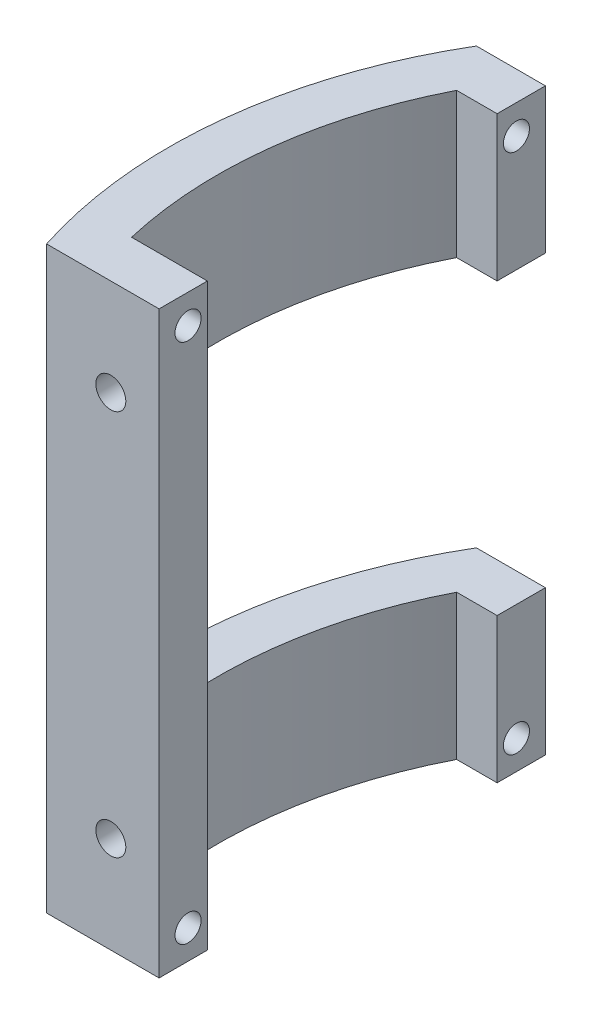
ISO-10303-21;
HEADER;
FILE_DESCRIPTION(('STEP AP214'),'2;1');
FILE_NAME('part.step','',(''),(''),'','','');
FILE_SCHEMA(('AUTOMOTIVE_DESIGN { 1 0 10303 214 1 1 1 1 }'));
ENDSEC;
DATA;
#1=APPLICATION_CONTEXT('core data for automotive mechanical design processes');
#2=APPLICATION_PROTOCOL_DEFINITION('international standard','automotive_design',2000,#1);
#3=PRODUCT_CONTEXT('',#1,'mechanical');
#4=PRODUCT('Part','Part','',(#3));
#5=PRODUCT_RELATED_PRODUCT_CATEGORY('part','',(#4));
#6=PRODUCT_DEFINITION_FORMATION('','',#4);
#7=PRODUCT_DEFINITION_CONTEXT('part definition',#1,'design');
#8=PRODUCT_DEFINITION('design','',#6,#7);
#9=PRODUCT_DEFINITION_SHAPE('','',#8);
#10=(LENGTH_UNIT() NAMED_UNIT(*) SI_UNIT(.MILLI.,.METRE.));
#11=(NAMED_UNIT(*) PLANE_ANGLE_UNIT() SI_UNIT($,.RADIAN.));
#12=(NAMED_UNIT(*) SI_UNIT($,.STERADIAN.) SOLID_ANGLE_UNIT());
#13=UNCERTAINTY_MEASURE_WITH_UNIT(LENGTH_MEASURE(1.E-05),#10,'distance_accuracy_value','');
#14=(GEOMETRIC_REPRESENTATION_CONTEXT(3) GLOBAL_UNCERTAINTY_ASSIGNED_CONTEXT((#13)) GLOBAL_UNIT_ASSIGNED_CONTEXT((#10,
#11,#12)) REPRESENTATION_CONTEXT('',''));
#15=CARTESIAN_POINT('',(0.,0.,0.));
#16=DIRECTION('',(0.,0.,1.));
#17=DIRECTION('',(1.,0.,0.));
#18=AXIS2_PLACEMENT_3D('',#15,#16,#17);
#19=CARTESIAN_POINT('',(0.,60.,0.));
#20=DIRECTION('',(0.,-1.,0.));
#21=DIRECTION('',(0.,0.,-1.));
#22=AXIS2_PLACEMENT_3D('',#19,#20,#21);
#23=CYLINDRICAL_SURFACE('',#22,44.);
#24=CARTESIAN_POINT('',(0.,15.,0.));
#25=DIRECTION('',(0.,-1.,0.));
#26=DIRECTION('',(0.,0.,-1.));
#27=AXIS2_PLACEMENT_3D('',#24,#25,#26);
#28=CIRCLE('',#27,44.);
#29=CARTESIAN_POINT('',(-42.8485705712571,15.,10.));
#30=VERTEX_POINT('',#29);
#31=CARTESIAN_POINT('',(-39.1918358845309,15.,-20.));
#32=VERTEX_POINT('',#31);
#33=EDGE_CURVE('E201',#30,#32,#28,.T.);
#34=ORIENTED_EDGE('',*,*,#33,.F.);
#35=DIRECTION('',(0.,-1.,0.));
#36=VECTOR('',#35,1.);
#37=CARTESIAN_POINT('',(-42.8485705712571,60.,10.));
#38=LINE('',#37,#36);
#39=CARTESIAN_POINT('',(-42.8485705712571,0.,10.));
#40=VERTEX_POINT('',#39);
#41=EDGE_CURVE('E104',#30,#40,#38,.T.);
#42=ORIENTED_EDGE('',*,*,#41,.T.);
#43=CARTESIAN_POINT('',(0.,0.,0.));
#44=DIRECTION('',(0.,1.,0.));
#45=DIRECTION('',(0.,0.,1.));
#46=AXIS2_PLACEMENT_3D('',#43,#44,#45);
#47=CIRCLE('',#46,44.);
#48=CARTESIAN_POINT('',(-39.1918358845309,0.,-20.));
#49=VERTEX_POINT('',#48);
#50=EDGE_CURVE('E198',#49,#40,#47,.T.);
#51=ORIENTED_EDGE('',*,*,#50,.F.);
#52=DIRECTION('',(0.,-1.,0.));
#53=VECTOR('',#52,1.);
#54=CARTESIAN_POINT('',(-39.1918358845309,60.,-20.));
#55=LINE('',#54,#53);
#56=EDGE_CURVE('E53',#32,#49,#55,.T.);
#57=ORIENTED_EDGE('',*,*,#56,.F.);
#58=EDGE_LOOP('',(#34,#42,#51,#57));
#59=FACE_BOUND('',#58,.T.);
#60=ADVANCED_FACE('F44',(#59),#23,.F.);
#61=CARTESIAN_POINT('',(0.,60.,-20.));
#62=DIRECTION('',(0.,0.,-1.));
#63=DIRECTION('',(-1.,0.,0.));
#64=AXIS2_PLACEMENT_3D('',#61,#62,#63);
#65=PLANE('',#64);
#66=DIRECTION('',(0.,-1.,0.));
#67=VECTOR('',#66,1.);
#68=CARTESIAN_POINT('',(-35.,60.,-20.));
#69=LINE('',#68,#67);
#70=CARTESIAN_POINT('',(-35.,15.,-20.));
#71=VERTEX_POINT('',#70);
#72=CARTESIAN_POINT('',(-35.,0.,-20.));
#73=VERTEX_POINT('',#72);
#74=EDGE_CURVE('E293',#71,#73,#69,.T.);
#75=ORIENTED_EDGE('',*,*,#74,.F.);
#76=DIRECTION('',(-1.,0.,0.));
#77=VECTOR('',#76,1.);
#78=CARTESIAN_POINT('',(0.,15.,-20.));
#79=LINE('',#78,#77);
#80=EDGE_CURVE('E205',#71,#32,#79,.T.);
#81=ORIENTED_EDGE('',*,*,#80,.T.);
#82=ORIENTED_EDGE('',*,*,#56,.T.);
#83=DIRECTION('',(1.,0.,0.));
#84=VECTOR('',#83,1.);
#85=CARTESIAN_POINT('',(0.,0.,-20.));
#86=LINE('',#85,#84);
#87=EDGE_CURVE('E306',#49,#73,#86,.T.);
#88=ORIENTED_EDGE('',*,*,#87,.T.);
#89=EDGE_LOOP('',(#75,#81,#82,#88));
#90=FACE_BOUND('',#89,.T.);
#91=ADVANCED_FACE('F285',(#90),#65,.F.);
#92=CARTESIAN_POINT('',(-35.,60.,0.));
#93=DIRECTION('',(1.,0.,0.));
#94=DIRECTION('',(0.,0.,-1.));
#95=AXIS2_PLACEMENT_3D('',#92,#93,#94);
#96=PLANE('',#95);
#97=CARTESIAN_POINT('',(-35.,3.,-22.));
#98=DIRECTION('',(1.,0.,0.));
#99=DIRECTION('',(0.,0.,-1.));
#100=AXIS2_PLACEMENT_3D('',#97,#98,#99);
#101=CIRCLE('',#100,1.35);
#102=CARTESIAN_POINT('',(-35.,3.,-23.35));
#103=VERTEX_POINT('',#102);
#104=EDGE_CURVE('E260',#103,#103,#101,.T.);
#105=ORIENTED_EDGE('',*,*,#104,.F.);
#106=EDGE_LOOP('',(#105));
#107=FACE_BOUND('',#106,.T.);
#108=DIRECTION('',(0.,0.,-1.));
#109=VECTOR('',#108,1.);
#110=CARTESIAN_POINT('',(-35.,15.,10.));
#111=LINE('',#110,#109);
#112=CARTESIAN_POINT('',(-35.,15.,-25.));
#113=VERTEX_POINT('',#112);
#114=EDGE_CURVE('E229',#71,#113,#111,.T.);
#115=ORIENTED_EDGE('',*,*,#114,.F.);
#116=ORIENTED_EDGE('',*,*,#74,.T.);
#117=DIRECTION('',(0.,0.,1.));
#118=VECTOR('',#117,1.);
#119=CARTESIAN_POINT('',(-35.,0.,0.));
#120=LINE('',#119,#118);
#121=CARTESIAN_POINT('',(-35.,0.,-25.));
#122=VERTEX_POINT('',#121);
#123=EDGE_CURVE('E339',#122,#73,#120,.T.);
#124=ORIENTED_EDGE('',*,*,#123,.F.);
#125=DIRECTION('',(0.,-1.,0.));
#126=VECTOR('',#125,1.);
#127=CARTESIAN_POINT('',(-35.,60.,-25.));
#128=LINE('',#127,#126);
#129=EDGE_CURVE('E296',#113,#122,#128,.T.);
#130=ORIENTED_EDGE('',*,*,#129,.F.);
#131=EDGE_LOOP('',(#115,#116,#124,#130));
#132=FACE_BOUND('',#131,.T.);
#133=ADVANCED_FACE('F281',(#107,#132),#96,.T.);
#134=CARTESIAN_POINT('',(0.,60.,-25.));
#135=DIRECTION('',(0.,0.,-1.));
#136=DIRECTION('',(-1.,0.,0.));
#137=AXIS2_PLACEMENT_3D('',#134,#135,#136);
#138=PLANE('',#137);
#139=DIRECTION('',(1.,0.,0.));
#140=VECTOR('',#139,1.);
#141=CARTESIAN_POINT('',(-49.,15.,-25.));
#142=LINE('',#141,#140);
#143=CARTESIAN_POINT('',(-42.142615011411,15.,-25.));
#144=VERTEX_POINT('',#143);
#145=EDGE_CURVE('E223',#144,#113,#142,.T.);
#146=ORIENTED_EDGE('',*,*,#145,.T.);
#147=ORIENTED_EDGE('',*,*,#129,.T.);
#148=DIRECTION('',(1.,0.,0.));
#149=VECTOR('',#148,1.);
#150=CARTESIAN_POINT('',(0.,0.,-25.));
#151=LINE('',#150,#149);
#152=CARTESIAN_POINT('',(-42.142615011411,0.,-25.));
#153=VERTEX_POINT('',#152);
#154=EDGE_CURVE('E335',#153,#122,#151,.T.);
#155=ORIENTED_EDGE('',*,*,#154,.F.);
#156=DIRECTION('',(0.,-1.,0.));
#157=VECTOR('',#156,1.);
#158=CARTESIAN_POINT('',(-42.142615011411,60.,-25.));
#159=LINE('',#158,#157);
#160=EDGE_CURVE('E319',#144,#153,#159,.T.);
#161=ORIENTED_EDGE('',*,*,#160,.F.);
#162=EDGE_LOOP('',(#146,#147,#155,#161));
#163=FACE_BOUND('',#162,.T.);
#164=ADVANCED_FACE('F284',(#163),#138,.T.);
#165=CARTESIAN_POINT('',(0.,45.,0.));
#166=DIRECTION('',(0.,1.,0.));
#167=DIRECTION('',(0.,0.,1.));
#168=AXIS2_PLACEMENT_3D('',#165,#166,#167);
#169=CIRCLE('',#168,44.);
#170=CARTESIAN_POINT('',(-39.1918358845309,45.,-20.));
#171=VERTEX_POINT('',#170);
#172=CARTESIAN_POINT('',(-42.8485705712571,45.,10.));
#173=VERTEX_POINT('',#172);
#174=EDGE_CURVE('E213',#171,#173,#169,.T.);
#175=ORIENTED_EDGE('',*,*,#174,.F.);
#176=CARTESIAN_POINT('',(-39.1918358845309,60.,-20.));
#177=VERTEX_POINT('',#176);
#178=EDGE_CURVE('E11',#177,#171,#55,.T.);
#179=ORIENTED_EDGE('',*,*,#178,.F.);
#180=CARTESIAN_POINT('',(0.,60.,0.));
#181=DIRECTION('',(0.,1.,0.));
#182=DIRECTION('',(0.,0.,1.));
#183=AXIS2_PLACEMENT_3D('',#180,#181,#182);
#184=CIRCLE('',#183,44.);
#185=CARTESIAN_POINT('',(-42.8485705712571,60.,10.));
#186=VERTEX_POINT('',#185);
#187=EDGE_CURVE('E175',#177,#186,#184,.T.);
#188=ORIENTED_EDGE('',*,*,#187,.T.);
#189=EDGE_CURVE('E69',#186,#173,#38,.T.);
#190=ORIENTED_EDGE('',*,*,#189,.T.);
#191=EDGE_LOOP('',(#175,#179,#188,#190));
#192=FACE_BOUND('',#191,.T.);
#193=ADVANCED_FACE('F46',(#192),#23,.F.);
#194=ORIENTED_EDGE('',*,*,#178,.T.);
#195=DIRECTION('',(1.,0.,0.));
#196=VECTOR('',#195,1.);
#197=CARTESIAN_POINT('',(0.,45.,-20.));
#198=LINE('',#197,#196);
#199=CARTESIAN_POINT('',(-35.,45.,-20.));
#200=VERTEX_POINT('',#199);
#201=EDGE_CURVE('E217',#171,#200,#198,.T.);
#202=ORIENTED_EDGE('',*,*,#201,.T.);
#203=CARTESIAN_POINT('',(-35.,60.,-20.));
#204=VERTEX_POINT('',#203);
#205=EDGE_CURVE('E309',#204,#200,#69,.T.);
#206=ORIENTED_EDGE('',*,*,#205,.F.);
#207=DIRECTION('',(1.,0.,0.));
#208=VECTOR('',#207,1.);
#209=CARTESIAN_POINT('',(0.,60.,-20.));
#210=LINE('',#209,#208);
#211=EDGE_CURVE('E168',#177,#204,#210,.T.);
#212=ORIENTED_EDGE('',*,*,#211,.F.);
#213=EDGE_LOOP('',(#194,#202,#206,#212));
#214=FACE_BOUND('',#213,.T.);
#215=ADVANCED_FACE('F387',(#214),#65,.F.);
#216=CARTESIAN_POINT('',(-35.,57.,-22.));
#217=DIRECTION('',(1.,0.,0.));
#218=DIRECTION('',(0.,0.,-1.));
#219=AXIS2_PLACEMENT_3D('',#216,#217,#218);
#220=CIRCLE('',#219,1.35);
#221=CARTESIAN_POINT('',(-35.,57.,-23.35));
#222=VERTEX_POINT('',#221);
#223=EDGE_CURVE('E251',#222,#222,#220,.T.);
#224=ORIENTED_EDGE('',*,*,#223,.F.);
#225=EDGE_LOOP('',(#224));
#226=FACE_BOUND('',#225,.T.);
#227=DIRECTION('',(0.,0.,1.));
#228=VECTOR('',#227,1.);
#229=CARTESIAN_POINT('',(-35.,45.,-25.));
#230=LINE('',#229,#228);
#231=CARTESIAN_POINT('',(-35.,45.,-25.));
#232=VERTEX_POINT('',#231);
#233=EDGE_CURVE('E242',#232,#200,#230,.T.);
#234=ORIENTED_EDGE('',*,*,#233,.F.);
#235=CARTESIAN_POINT('',(-35.,60.,-25.));
#236=VERTEX_POINT('',#235);
#237=EDGE_CURVE('E310',#236,#232,#128,.T.);
#238=ORIENTED_EDGE('',*,*,#237,.F.);
#239=DIRECTION('',(0.,0.,1.));
#240=VECTOR('',#239,1.);
#241=CARTESIAN_POINT('',(-35.,60.,0.));
#242=LINE('',#241,#240);
#243=EDGE_CURVE('E160',#236,#204,#242,.T.);
#244=ORIENTED_EDGE('',*,*,#243,.T.);
#245=ORIENTED_EDGE('',*,*,#205,.T.);
#246=EDGE_LOOP('',(#234,#238,#244,#245));
#247=FACE_BOUND('',#246,.T.);
#248=ADVANCED_FACE('F287',(#226,#247),#96,.T.);
#249=DIRECTION('',(1.,0.,0.));
#250=VECTOR('',#249,1.);
#251=CARTESIAN_POINT('',(-49.,45.,-25.));
#252=LINE('',#251,#250);
#253=CARTESIAN_POINT('',(-42.142615011411,45.,-25.));
#254=VERTEX_POINT('',#253);
#255=EDGE_CURVE('E224',#254,#232,#252,.T.);
#256=ORIENTED_EDGE('',*,*,#255,.F.);
#257=CARTESIAN_POINT('',(-42.142615011411,60.,-25.));
#258=VERTEX_POINT('',#257);
#259=EDGE_CURVE('E316',#258,#254,#159,.T.);
#260=ORIENTED_EDGE('',*,*,#259,.F.);
#261=DIRECTION('',(1.,0.,0.));
#262=VECTOR('',#261,1.);
#263=CARTESIAN_POINT('',(0.,60.,-25.));
#264=LINE('',#263,#262);
#265=EDGE_CURVE('E167',#258,#236,#264,.T.);
#266=ORIENTED_EDGE('',*,*,#265,.T.);
#267=ORIENTED_EDGE('',*,*,#237,.T.);
#268=EDGE_LOOP('',(#256,#260,#266,#267));
#269=FACE_BOUND('',#268,.T.);
#270=ADVANCED_FACE('F395',(#269),#138,.T.);
#271=CARTESIAN_POINT('',(0.,60.,0.));
#272=DIRECTION('',(0.,-1.,0.));
#273=DIRECTION('',(0.,0.,-1.));
#274=AXIS2_PLACEMENT_3D('',#271,#272,#273);
#275=CYLINDRICAL_SURFACE('',#274,49.);
#276=ORIENTED_EDGE('',*,*,#259,.T.);
#277=CARTESIAN_POINT('',(0.,45.,0.));
#278=DIRECTION('',(0.,1.,0.));
#279=DIRECTION('',(0.,0.,1.));
#280=AXIS2_PLACEMENT_3D('',#277,#278,#279);
#281=CIRCLE('',#280,49.);
#282=CARTESIAN_POINT('',(-47.9687398208458,45.,10.));
#283=VERTEX_POINT('',#282);
#284=EDGE_CURVE('E60',#254,#283,#281,.T.);
#285=ORIENTED_EDGE('',*,*,#284,.T.);
#286=DIRECTION('',(0.,-1.,0.));
#287=VECTOR('',#286,1.);
#288=CARTESIAN_POINT('',(-47.9687398208458,60.,10.));
#289=LINE('',#288,#287);
#290=CARTESIAN_POINT('',(-47.9687398208458,15.,10.));
#291=VERTEX_POINT('',#290);
#292=EDGE_CURVE('E186',#283,#291,#289,.T.);
#293=ORIENTED_EDGE('',*,*,#292,.T.);
#294=CARTESIAN_POINT('',(0.,15.,0.));
#295=DIRECTION('',(0.,-1.,0.));
#296=DIRECTION('',(0.,0.,-1.));
#297=AXIS2_PLACEMENT_3D('',#294,#295,#296);
#298=CIRCLE('',#297,49.);
#299=EDGE_CURVE('E209',#291,#144,#298,.T.);
#300=ORIENTED_EDGE('',*,*,#299,.T.);
#301=ORIENTED_EDGE('',*,*,#160,.T.);
#302=CARTESIAN_POINT('',(0.,0.,0.));
#303=DIRECTION('',(0.,1.,0.));
#304=DIRECTION('',(0.,0.,1.));
#305=AXIS2_PLACEMENT_3D('',#302,#303,#304);
#306=CIRCLE('',#305,49.);
#307=CARTESIAN_POINT('',(-46.6476151587624,0.,15.));
#308=VERTEX_POINT('',#307);
#309=EDGE_CURVE('E332',#153,#308,#306,.T.);
#310=ORIENTED_EDGE('',*,*,#309,.T.);
#311=DIRECTION('',(0.,-1.,0.));
#312=VECTOR('',#311,1.);
#313=CARTESIAN_POINT('',(-46.6476151587624,60.,15.));
#314=LINE('',#313,#312);
#315=CARTESIAN_POINT('',(-46.6476151587624,60.,15.));
#316=VERTEX_POINT('',#315);
#317=EDGE_CURVE('E153',#316,#308,#314,.T.);
#318=ORIENTED_EDGE('',*,*,#317,.F.);
#319=CARTESIAN_POINT('',(0.,60.,0.));
#320=DIRECTION('',(0.,1.,0.));
#321=DIRECTION('',(0.,0.,1.));
#322=AXIS2_PLACEMENT_3D('',#319,#320,#321);
#323=CIRCLE('',#322,49.);
#324=EDGE_CURVE('E138',#258,#316,#323,.T.);
#325=ORIENTED_EDGE('',*,*,#324,.F.);
#326=EDGE_LOOP('',(#276,#285,#293,#300,#301,#310,#318,#325));
#327=FACE_BOUND('',#326,.T.);
#328=ADVANCED_FACE('F363',(#327),#275,.T.);
#329=CARTESIAN_POINT('',(0.,60.,15.));
#330=DIRECTION('',(0.,0.,-1.));
#331=DIRECTION('',(-1.,0.,0.));
#332=AXIS2_PLACEMENT_3D('',#329,#330,#331);
#333=PLANE('',#332);
#334=CARTESIAN_POINT('',(-39.9976151587624,50.,15.));
#335=DIRECTION('',(0.,0.,-1.));
#336=DIRECTION('',(-1.,0.,0.));
#337=AXIS2_PLACEMENT_3D('',#334,#335,#336);
#338=CIRCLE('',#337,1.55);
#339=CARTESIAN_POINT('',(-41.5476151587624,50.,15.));
#340=VERTEX_POINT('',#339);
#341=EDGE_CURVE('E194',#340,#340,#338,.T.);
#342=ORIENTED_EDGE('',*,*,#341,.T.);
#343=EDGE_LOOP('',(#342));
#344=FACE_BOUND('',#343,.T.);
#345=CARTESIAN_POINT('',(-39.9976151587624,9.99999999999999,15.));
#346=DIRECTION('',(0.,0.,-1.));
#347=DIRECTION('',(-1.,0.,0.));
#348=AXIS2_PLACEMENT_3D('',#345,#346,#347);
#349=CIRCLE('',#348,1.55);
#350=CARTESIAN_POINT('',(-41.5476151587624,9.99999999999999,15.));
#351=VERTEX_POINT('',#350);
#352=EDGE_CURVE('E181',#351,#351,#349,.T.);
#353=ORIENTED_EDGE('',*,*,#352,.T.);
#354=EDGE_LOOP('',(#353));
#355=FACE_BOUND('',#354,.T.);
#356=DIRECTION('',(1.,0.,0.));
#357=VECTOR('',#356,1.);
#358=CARTESIAN_POINT('',(0.,0.,15.));
#359=LINE('',#358,#357);
#360=CARTESIAN_POINT('',(-35.,0.,15.));
#361=VERTEX_POINT('',#360);
#362=EDGE_CURVE('E148',#308,#361,#359,.T.);
#363=ORIENTED_EDGE('',*,*,#362,.T.);
#364=DIRECTION('',(0.,-1.,0.));
#365=VECTOR('',#364,1.);
#366=CARTESIAN_POINT('',(-35.,60.,15.));
#367=LINE('',#366,#365);
#368=CARTESIAN_POINT('',(-35.,60.,15.));
#369=VERTEX_POINT('',#368);
#370=EDGE_CURVE('E145',#369,#361,#367,.T.);
#371=ORIENTED_EDGE('',*,*,#370,.F.);
#372=DIRECTION('',(1.,0.,0.));
#373=VECTOR('',#372,1.);
#374=CARTESIAN_POINT('',(0.,60.,15.));
#375=LINE('',#374,#373);
#376=EDGE_CURVE('E129',#316,#369,#375,.T.);
#377=ORIENTED_EDGE('',*,*,#376,.F.);
#378=ORIENTED_EDGE('',*,*,#317,.T.);
#379=EDGE_LOOP('',(#363,#371,#377,#378));
#380=FACE_BOUND('',#379,.T.);
#381=ADVANCED_FACE('F146',(#344,#355,#380),#333,.F.);
#382=CARTESIAN_POINT('',(-35.,3.,12.));
#383=DIRECTION('',(1.,0.,0.));
#384=DIRECTION('',(0.,0.,-1.));
#385=AXIS2_PLACEMENT_3D('',#382,#383,#384);
#386=CIRCLE('',#385,1.35);
#387=CARTESIAN_POINT('',(-35.,3.,10.65));
#388=VERTEX_POINT('',#387);
#389=EDGE_CURVE('E259',#388,#388,#386,.T.);
#390=ORIENTED_EDGE('',*,*,#389,.F.);
#391=EDGE_LOOP('',(#390));
#392=FACE_BOUND('',#391,.T.);
#393=CARTESIAN_POINT('',(-35.,57.,12.));
#394=DIRECTION('',(1.,0.,0.));
#395=DIRECTION('',(0.,0.,-1.));
#396=AXIS2_PLACEMENT_3D('',#393,#394,#395);
#397=CIRCLE('',#396,1.35);
#398=CARTESIAN_POINT('',(-35.,57.,10.65));
#399=VERTEX_POINT('',#398);
#400=EDGE_CURVE('E247',#399,#399,#397,.T.);
#401=ORIENTED_EDGE('',*,*,#400,.F.);
#402=EDGE_LOOP('',(#401));
#403=FACE_BOUND('',#402,.T.);
#404=CARTESIAN_POINT('',(-35.,0.,10.));
#405=VERTEX_POINT('',#404);
#406=EDGE_CURVE('E329',#405,#361,#120,.T.);
#407=ORIENTED_EDGE('',*,*,#406,.F.);
#408=DIRECTION('',(0.,-1.,0.));
#409=VECTOR('',#408,1.);
#410=CARTESIAN_POINT('',(-35.,60.,10.));
#411=LINE('',#410,#409);
#412=CARTESIAN_POINT('',(-35.,60.,10.));
#413=VERTEX_POINT('',#412);
#414=EDGE_CURVE('E154',#413,#405,#411,.T.);
#415=ORIENTED_EDGE('',*,*,#414,.F.);
#416=EDGE_CURVE('E135',#413,#369,#242,.T.);
#417=ORIENTED_EDGE('',*,*,#416,.T.);
#418=ORIENTED_EDGE('',*,*,#370,.T.);
#419=EDGE_LOOP('',(#407,#415,#417,#418));
#420=FACE_BOUND('',#419,.T.);
#421=ADVANCED_FACE('F156',(#392,#403,#420),#96,.T.);
#422=CARTESIAN_POINT('',(0.,60.,10.));
#423=DIRECTION('',(0.,0.,-1.));
#424=DIRECTION('',(-1.,0.,0.));
#425=AXIS2_PLACEMENT_3D('',#422,#423,#424);
#426=PLANE('',#425);
#427=ORIENTED_EDGE('',*,*,#414,.T.);
#428=DIRECTION('',(1.,0.,0.));
#429=VECTOR('',#428,1.);
#430=CARTESIAN_POINT('',(0.,0.,10.));
#431=LINE('',#430,#429);
#432=EDGE_CURVE('E178',#40,#405,#431,.T.);
#433=ORIENTED_EDGE('',*,*,#432,.F.);
#434=ORIENTED_EDGE('',*,*,#41,.F.);
#435=DIRECTION('',(1.,0.,0.));
#436=VECTOR('',#435,1.);
#437=CARTESIAN_POINT('',(-49.,15.,10.));
#438=LINE('',#437,#436);
#439=EDGE_CURVE('E232',#291,#30,#438,.T.);
#440=ORIENTED_EDGE('',*,*,#439,.F.);
#441=ORIENTED_EDGE('',*,*,#292,.F.);
#442=DIRECTION('',(1.,0.,0.));
#443=VECTOR('',#442,1.);
#444=CARTESIAN_POINT('',(-49.,45.,10.));
#445=LINE('',#444,#443);
#446=EDGE_CURVE('E228',#283,#173,#445,.T.);
#447=ORIENTED_EDGE('',*,*,#446,.T.);
#448=ORIENTED_EDGE('',*,*,#189,.F.);
#449=DIRECTION('',(1.,0.,0.));
#450=VECTOR('',#449,1.);
#451=CARTESIAN_POINT('',(0.,60.,10.));
#452=LINE('',#451,#450);
#453=EDGE_CURVE('E158',#186,#413,#452,.T.);
#454=ORIENTED_EDGE('',*,*,#453,.T.);
#455=EDGE_LOOP('',(#427,#433,#434,#440,#441,#447,#448,#454));
#456=FACE_BOUND('',#455,.T.);
#457=CARTESIAN_POINT('',(-39.9976151587624,50.,10.));
#458=DIRECTION('',(0.,0.,-1.));
#459=DIRECTION('',(-1.,0.,0.));
#460=AXIS2_PLACEMENT_3D('',#457,#458,#459);
#461=CIRCLE('',#460,1.55);
#462=CARTESIAN_POINT('',(-41.5476151587624,50.,10.));
#463=VERTEX_POINT('',#462);
#464=EDGE_CURVE('E190',#463,#463,#461,.T.);
#465=ORIENTED_EDGE('',*,*,#464,.F.);
#466=EDGE_LOOP('',(#465));
#467=FACE_BOUND('',#466,.T.);
#468=CARTESIAN_POINT('',(-39.9976151587624,9.99999999999999,10.));
#469=DIRECTION('',(0.,0.,-1.));
#470=DIRECTION('',(-1.,0.,0.));
#471=AXIS2_PLACEMENT_3D('',#468,#469,#470);
#472=CIRCLE('',#471,1.55);
#473=CARTESIAN_POINT('',(-41.5476151587624,9.99999999999999,10.));
#474=VERTEX_POINT('',#473);
#475=EDGE_CURVE('E185',#474,#474,#472,.T.);
#476=ORIENTED_EDGE('',*,*,#475,.F.);
#477=EDGE_LOOP('',(#476));
#478=FACE_BOUND('',#477,.T.);
#479=ADVANCED_FACE('F350',(#456,#467,#478),#426,.T.);
#480=CARTESIAN_POINT('',(0.,60.,0.));
#481=DIRECTION('',(0.,1.,0.));
#482=DIRECTION('',(0.,0.,1.));
#483=AXIS2_PLACEMENT_3D('',#480,#481,#482);
#484=PLANE('',#483);
#485=ORIENTED_EDGE('',*,*,#187,.F.);
#486=ORIENTED_EDGE('',*,*,#211,.T.);
#487=ORIENTED_EDGE('',*,*,#243,.F.);
#488=ORIENTED_EDGE('',*,*,#265,.F.);
#489=ORIENTED_EDGE('',*,*,#324,.T.);
#490=ORIENTED_EDGE('',*,*,#376,.T.);
#491=ORIENTED_EDGE('',*,*,#416,.F.);
#492=ORIENTED_EDGE('',*,*,#453,.F.);
#493=EDGE_LOOP('',(#485,#486,#487,#488,#489,#490,#491,#492));
#494=FACE_BOUND('',#493,.T.);
#495=ADVANCED_FACE('F132',(#494),#484,.T.);
#496=CARTESIAN_POINT('',(0.,0.,0.));
#497=DIRECTION('',(0.,1.,0.));
#498=DIRECTION('',(0.,0.,1.));
#499=AXIS2_PLACEMENT_3D('',#496,#497,#498);
#500=PLANE('',#499);
#501=ORIENTED_EDGE('',*,*,#50,.T.);
#502=ORIENTED_EDGE('',*,*,#432,.T.);
#503=ORIENTED_EDGE('',*,*,#406,.T.);
#504=ORIENTED_EDGE('',*,*,#362,.F.);
#505=ORIENTED_EDGE('',*,*,#309,.F.);
#506=ORIENTED_EDGE('',*,*,#154,.T.);
#507=ORIENTED_EDGE('',*,*,#123,.T.);
#508=ORIENTED_EDGE('',*,*,#87,.F.);
#509=EDGE_LOOP('',(#501,#502,#503,#504,#505,#506,#507,#508));
#510=FACE_BOUND('',#509,.T.);
#511=ADVANCED_FACE('F349',(#510),#500,.F.);
#512=CARTESIAN_POINT('',(-39.9976151587624,9.99999999999999,15.));
#513=DIRECTION('',(0.,0.,-1.));
#514=DIRECTION('',(-1.,0.,0.));
#515=AXIS2_PLACEMENT_3D('',#512,#513,#514);
#516=CYLINDRICAL_SURFACE('',#515,1.55);
#517=ORIENTED_EDGE('',*,*,#352,.F.);
#518=EDGE_LOOP('',(#517));
#519=FACE_BOUND('',#518,.T.);
#520=ORIENTED_EDGE('',*,*,#475,.T.);
#521=EDGE_LOOP('',(#520));
#522=FACE_BOUND('',#521,.T.);
#523=ADVANCED_FACE('F379',(#519,#522),#516,.F.);
#524=CARTESIAN_POINT('',(-39.9976151587624,50.,15.));
#525=DIRECTION('',(0.,0.,-1.));
#526=DIRECTION('',(-1.,0.,0.));
#527=AXIS2_PLACEMENT_3D('',#524,#525,#526);
#528=CYLINDRICAL_SURFACE('',#527,1.55);
#529=ORIENTED_EDGE('',*,*,#341,.F.);
#530=EDGE_LOOP('',(#529));
#531=FACE_BOUND('',#530,.T.);
#532=ORIENTED_EDGE('',*,*,#464,.T.);
#533=EDGE_LOOP('',(#532));
#534=FACE_BOUND('',#533,.T.);
#535=ADVANCED_FACE('F370',(#531,#534),#528,.F.);
#536=CARTESIAN_POINT('',(-49.,15.,10.));
#537=DIRECTION('',(0.,-1.,0.));
#538=DIRECTION('',(0.,0.,-1.));
#539=AXIS2_PLACEMENT_3D('',#536,#537,#538);
#540=PLANE('',#539);
#541=ORIENTED_EDGE('',*,*,#33,.T.);
#542=ORIENTED_EDGE('',*,*,#80,.F.);
#543=ORIENTED_EDGE('',*,*,#114,.T.);
#544=ORIENTED_EDGE('',*,*,#145,.F.);
#545=ORIENTED_EDGE('',*,*,#299,.F.);
#546=ORIENTED_EDGE('',*,*,#439,.T.);
#547=EDGE_LOOP('',(#541,#542,#543,#544,#545,#546));
#548=FACE_BOUND('',#547,.T.);
#549=ADVANCED_FACE('F367',(#548),#540,.F.);
#550=CARTESIAN_POINT('',(-49.,45.,-25.));
#551=DIRECTION('',(0.,1.,0.));
#552=DIRECTION('',(0.,0.,1.));
#553=AXIS2_PLACEMENT_3D('',#550,#551,#552);
#554=PLANE('',#553);
#555=ORIENTED_EDGE('',*,*,#174,.T.);
#556=ORIENTED_EDGE('',*,*,#446,.F.);
#557=ORIENTED_EDGE('',*,*,#284,.F.);
#558=ORIENTED_EDGE('',*,*,#255,.T.);
#559=ORIENTED_EDGE('',*,*,#233,.T.);
#560=ORIENTED_EDGE('',*,*,#201,.F.);
#561=EDGE_LOOP('',(#555,#556,#557,#558,#559,#560));
#562=FACE_BOUND('',#561,.T.);
#563=ADVANCED_FACE('F369',(#562),#554,.F.);
#564=CARTESIAN_POINT('',(-40.,57.,12.));
#565=DIRECTION('',(1.,0.,0.));
#566=DIRECTION('',(0.,0.,-1.));
#567=AXIS2_PLACEMENT_3D('',#564,#565,#566);
#568=CYLINDRICAL_SURFACE('',#567,1.35);
#569=CARTESIAN_POINT('',(-40.,57.,12.));
#570=DIRECTION('',(1.,0.,0.));
#571=DIRECTION('',(0.,0.,-1.));
#572=AXIS2_PLACEMENT_3D('',#569,#570,#571);
#573=CIRCLE('',#572,1.35);
#574=CARTESIAN_POINT('',(-40.,57.,10.65));
#575=VERTEX_POINT('',#574);
#576=EDGE_CURVE('E246',#575,#575,#573,.T.);
#577=ORIENTED_EDGE('',*,*,#576,.F.);
#578=EDGE_LOOP('',(#577));
#579=FACE_BOUND('',#578,.T.);
#580=ORIENTED_EDGE('',*,*,#400,.T.);
#581=EDGE_LOOP('',(#580));
#582=FACE_BOUND('',#581,.T.);
#583=ADVANCED_FACE('F376',(#579,#582),#568,.F.);
#584=CARTESIAN_POINT('',(-40.,57.,12.));
#585=DIRECTION('',(1.,0.,0.));
#586=DIRECTION('',(0.,0.,-1.));
#587=AXIS2_PLACEMENT_3D('',#584,#585,#586);
#588=PLANE('',#587);
#589=ORIENTED_EDGE('',*,*,#576,.T.);
#590=EDGE_LOOP('',(#589));
#591=FACE_BOUND('',#590,.T.);
#592=ADVANCED_FACE('F537',(#591),#588,.T.);
#593=CARTESIAN_POINT('',(-40.,3.,12.));
#594=DIRECTION('',(1.,0.,0.));
#595=DIRECTION('',(0.,0.,-1.));
#596=AXIS2_PLACEMENT_3D('',#593,#594,#595);
#597=CYLINDRICAL_SURFACE('',#596,1.35);
#598=CARTESIAN_POINT('',(-40.,3.,12.));
#599=DIRECTION('',(1.,0.,0.));
#600=DIRECTION('',(0.,0.,-1.));
#601=AXIS2_PLACEMENT_3D('',#598,#599,#600);
#602=CIRCLE('',#601,1.35);
#603=CARTESIAN_POINT('',(-40.,3.,10.65));
#604=VERTEX_POINT('',#603);
#605=EDGE_CURVE('E255',#604,#604,#602,.T.);
#606=ORIENTED_EDGE('',*,*,#605,.F.);
#607=EDGE_LOOP('',(#606));
#608=FACE_BOUND('',#607,.T.);
#609=ORIENTED_EDGE('',*,*,#389,.T.);
#610=EDGE_LOOP('',(#609));
#611=FACE_BOUND('',#610,.T.);
#612=ADVANCED_FACE('F547',(#608,#611),#597,.F.);
#613=CARTESIAN_POINT('',(-40.,3.,12.));
#614=DIRECTION('',(1.,0.,0.));
#615=DIRECTION('',(0.,0.,-1.));
#616=AXIS2_PLACEMENT_3D('',#613,#614,#615);
#617=PLANE('',#616);
#618=ORIENTED_EDGE('',*,*,#605,.T.);
#619=EDGE_LOOP('',(#618));
#620=FACE_BOUND('',#619,.T.);
#621=ADVANCED_FACE('F558',(#620),#617,.T.);
#622=CARTESIAN_POINT('',(-40.,57.,-22.));
#623=DIRECTION('',(1.,0.,0.));
#624=DIRECTION('',(0.,0.,-1.));
#625=AXIS2_PLACEMENT_3D('',#622,#623,#624);
#626=CYLINDRICAL_SURFACE('',#625,1.35);
#627=CARTESIAN_POINT('',(-40.,57.,-22.));
#628=DIRECTION('',(1.,0.,0.));
#629=DIRECTION('',(0.,0.,-1.));
#630=AXIS2_PLACEMENT_3D('',#627,#628,#629);
#631=CIRCLE('',#630,1.35);
#632=CARTESIAN_POINT('',(-40.,57.,-23.35));
#633=VERTEX_POINT('',#632);
#634=EDGE_CURVE('E264',#633,#633,#631,.T.);
#635=ORIENTED_EDGE('',*,*,#634,.F.);
#636=EDGE_LOOP('',(#635));
#637=FACE_BOUND('',#636,.T.);
#638=ORIENTED_EDGE('',*,*,#223,.T.);
#639=EDGE_LOOP('',(#638));
#640=FACE_BOUND('',#639,.T.);
#641=ADVANCED_FACE('F569',(#637,#640),#626,.F.);
#642=CARTESIAN_POINT('',(-40.,57.,-22.));
#643=DIRECTION('',(1.,0.,0.));
#644=DIRECTION('',(0.,0.,-1.));
#645=AXIS2_PLACEMENT_3D('',#642,#643,#644);
#646=PLANE('',#645);
#647=ORIENTED_EDGE('',*,*,#634,.T.);
#648=EDGE_LOOP('',(#647));
#649=FACE_BOUND('',#648,.T.);
#650=ADVANCED_FACE('F580',(#649),#646,.T.);
#651=CARTESIAN_POINT('',(-40.,3.,-22.));
#652=DIRECTION('',(1.,0.,0.));
#653=DIRECTION('',(0.,0.,-1.));
#654=AXIS2_PLACEMENT_3D('',#651,#652,#653);
#655=CYLINDRICAL_SURFACE('',#654,1.35);
#656=CARTESIAN_POINT('',(-40.,3.,-22.));
#657=DIRECTION('',(1.,0.,0.));
#658=DIRECTION('',(0.,0.,-1.));
#659=AXIS2_PLACEMENT_3D('',#656,#657,#658);
#660=CIRCLE('',#659,1.35);
#661=CARTESIAN_POINT('',(-40.,3.,-23.35));
#662=VERTEX_POINT('',#661);
#663=EDGE_CURVE('E271',#662,#662,#660,.T.);
#664=ORIENTED_EDGE('',*,*,#663,.F.);
#665=EDGE_LOOP('',(#664));
#666=FACE_BOUND('',#665,.T.);
#667=ORIENTED_EDGE('',*,*,#104,.T.);
#668=EDGE_LOOP('',(#667));
#669=FACE_BOUND('',#668,.T.);
#670=ADVANCED_FACE('F279',(#666,#669),#655,.F.);
#671=CARTESIAN_POINT('',(-40.,3.,-22.));
#672=DIRECTION('',(1.,0.,0.));
#673=DIRECTION('',(0.,0.,-1.));
#674=AXIS2_PLACEMENT_3D('',#671,#672,#673);
#675=PLANE('',#674);
#676=ORIENTED_EDGE('',*,*,#663,.T.);
#677=EDGE_LOOP('',(#676));
#678=FACE_BOUND('',#677,.T.);
#679=ADVANCED_FACE('F601',(#678),#675,.T.);
#680=CLOSED_SHELL('',(#60,#91,#133,#164,#193,#215,#248,#270,#328,#381,#421,#479,#495,#511,#523,
#535,#549,#563,#583,#592,#612,#621,#641,#650,#670,#679));
#681=MANIFOLD_SOLID_BREP('B2',#680);
#682=ADVANCED_BREP_SHAPE_REPRESENTATION('',(#18,#681),#14);
#683=SHAPE_DEFINITION_REPRESENTATION(#9,#682);
ENDSEC;
END-ISO-10303-21;
